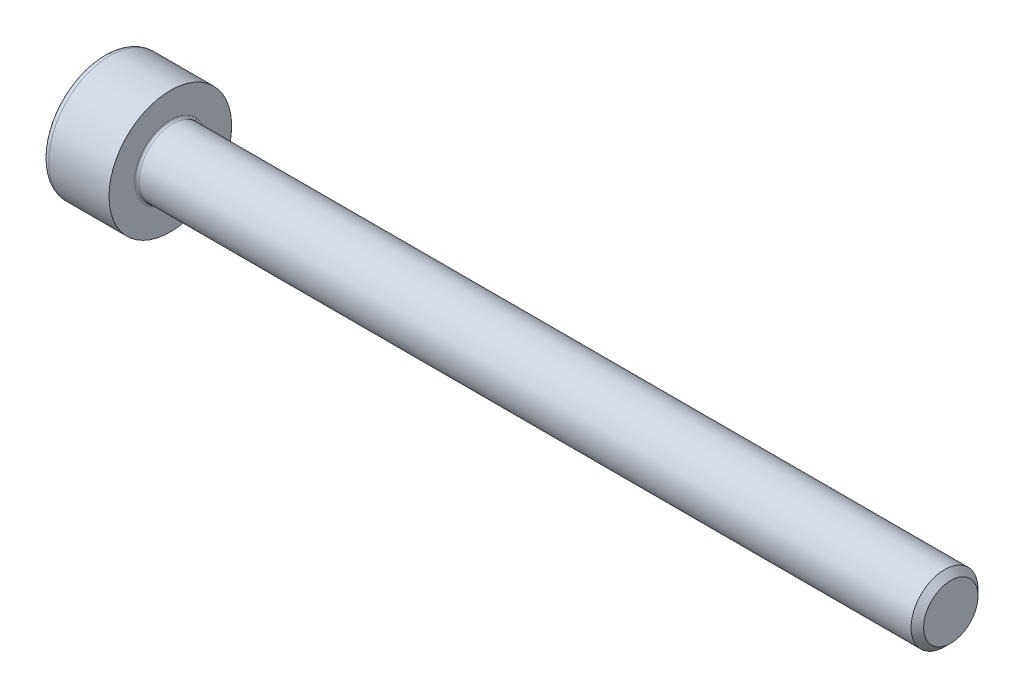
ISO-10303-21;
HEADER;
FILE_DESCRIPTION(('STEP AP214'),'2;1');
FILE_NAME('part.step','',(''),(''),'','','');
FILE_SCHEMA(('AUTOMOTIVE_DESIGN { 1 0 10303 214 1 1 1 1 }'));
ENDSEC;
DATA;
#1=APPLICATION_CONTEXT('core data for automotive mechanical design processes');
#2=APPLICATION_PROTOCOL_DEFINITION('international standard','automotive_design',2000,#1);
#3=PRODUCT_CONTEXT('',#1,'mechanical');
#4=PRODUCT('Part','Part','',(#3));
#5=PRODUCT_RELATED_PRODUCT_CATEGORY('part','',(#4));
#6=PRODUCT_DEFINITION_FORMATION('','',#4);
#7=PRODUCT_DEFINITION_CONTEXT('part definition',#1,'design');
#8=PRODUCT_DEFINITION('design','',#6,#7);
#9=PRODUCT_DEFINITION_SHAPE('','',#8);
#10=(LENGTH_UNIT() NAMED_UNIT(*) SI_UNIT(.MILLI.,.METRE.));
#11=(NAMED_UNIT(*) PLANE_ANGLE_UNIT() SI_UNIT($,.RADIAN.));
#12=(NAMED_UNIT(*) SI_UNIT($,.STERADIAN.) SOLID_ANGLE_UNIT());
#13=UNCERTAINTY_MEASURE_WITH_UNIT(LENGTH_MEASURE(1.E-05),#10,'distance_accuracy_value','');
#14=(GEOMETRIC_REPRESENTATION_CONTEXT(3) GLOBAL_UNCERTAINTY_ASSIGNED_CONTEXT((#13)) GLOBAL_UNIT_ASSIGNED_CONTEXT((#10,
#11,#12)) REPRESENTATION_CONTEXT('',''));
#15=CARTESIAN_POINT('',(0.,0.,0.));
#16=DIRECTION('',(0.,0.,1.));
#17=DIRECTION('',(1.,0.,0.));
#18=AXIS2_PLACEMENT_3D('',#15,#16,#17);
#19=CARTESIAN_POINT('',(0.,0.,0.));
#20=DIRECTION('',(-1.,0.,0.));
#21=DIRECTION('',(0.,0.,1.));
#22=AXIS2_PLACEMENT_3D('',#19,#20,#21);
#23=PLANE('',#22);
#24=DIRECTION('',(0.,-0.499999999999999,0.866025403784439));
#25=VECTOR('',#24,1.);
#26=CARTESIAN_POINT('',(0.,1.45492267835785,0.));
#27=LINE('',#26,#25);
#28=CARTESIAN_POINT('',(0.,1.45492267835785,0.));
#29=VERTEX_POINT('',#28);
#30=CARTESIAN_POINT('',(0.,0.727461339178922,1.26));
#31=VERTEX_POINT('',#30);
#32=EDGE_CURVE('E261',#29,#31,#27,.T.);
#33=ORIENTED_EDGE('',*,*,#32,.T.);
#34=DIRECTION('',(0.,1.,0.));
#35=VECTOR('',#34,1.);
#36=CARTESIAN_POINT('',(0.,-0.727461339178934,1.26));
#37=LINE('',#36,#35);
#38=CARTESIAN_POINT('',(0.,-0.727461339178934,1.26));
#39=VERTEX_POINT('',#38);
#40=EDGE_CURVE('E133',#39,#31,#37,.T.);
#41=ORIENTED_EDGE('',*,*,#40,.F.);
#42=DIRECTION('',(0.,-0.500000000000001,-0.866025403784438));
#43=VECTOR('',#42,1.);
#44=CARTESIAN_POINT('',(0.,-0.727461339178934,1.26));
#45=LINE('',#44,#43);
#46=CARTESIAN_POINT('',(0.,-1.45492267835786,0.));
#47=VERTEX_POINT('',#46);
#48=EDGE_CURVE('E264',#39,#47,#45,.T.);
#49=ORIENTED_EDGE('',*,*,#48,.T.);
#50=DIRECTION('',(0.,0.499999999999998,-0.86602540378444));
#51=VECTOR('',#50,1.);
#52=CARTESIAN_POINT('',(0.,-1.45492267835786,0.));
#53=LINE('',#52,#51);
#54=CARTESIAN_POINT('',(0.,-0.727461339178938,-1.26));
#55=VERTEX_POINT('',#54);
#56=EDGE_CURVE('E267',#47,#55,#53,.T.);
#57=ORIENTED_EDGE('',*,*,#56,.T.);
#58=DIRECTION('',(0.,-1.,0.));
#59=VECTOR('',#58,1.);
#60=CARTESIAN_POINT('',(0.,0.727461339178918,-1.26));
#61=LINE('',#60,#59);
#62=CARTESIAN_POINT('',(0.,0.727461339178918,-1.26));
#63=VERTEX_POINT('',#62);
#64=EDGE_CURVE('E270',#63,#55,#61,.T.);
#65=ORIENTED_EDGE('',*,*,#64,.F.);
#66=DIRECTION('',(0.,-0.500000000000001,-0.866025403784438));
#67=VECTOR('',#66,1.);
#68=CARTESIAN_POINT('',(0.,1.45492267835785,0.));
#69=LINE('',#68,#67);
#70=EDGE_CURVE('E128',#29,#63,#69,.T.);
#71=ORIENTED_EDGE('',*,*,#70,.F.);
#72=EDGE_LOOP('',(#33,#41,#49,#57,#65,#71));
#73=FACE_BOUND('',#72,.T.);
#74=CARTESIAN_POINT('',(0.,0.,0.));
#75=DIRECTION('',(-1.,0.,0.));
#76=DIRECTION('',(0.,0.,1.));
#77=AXIS2_PLACEMENT_3D('',#74,#75,#76);
#78=CIRCLE('',#77,2.45);
#79=CARTESIAN_POINT('',(0.,0.,2.45));
#80=VERTEX_POINT('',#79);
#81=EDGE_CURVE('E45',#80,#80,#78,.T.);
#82=ORIENTED_EDGE('',*,*,#81,.T.);
#83=EDGE_LOOP('',(#82));
#84=FACE_BOUND('',#83,.T.);
#85=ADVANCED_FACE('F37',(#73,#84),#23,.T.);
#86=CARTESIAN_POINT('',(-31.75,0.,0.));
#87=DIRECTION('',(-1.,0.,0.));
#88=DIRECTION('',(0.,0.,1.));
#89=AXIS2_PLACEMENT_3D('',#86,#87,#88);
#90=CYLINDRICAL_SURFACE('',#89,2.75);
#91=CARTESIAN_POINT('',(0.300000000000002,0.,0.));
#92=DIRECTION('',(-1.,0.,0.));
#93=DIRECTION('',(0.,0.,1.));
#94=AXIS2_PLACEMENT_3D('',#91,#92,#93);
#95=CIRCLE('',#94,2.75);
#96=CARTESIAN_POINT('',(0.300000000000002,0.,2.75));
#97=VERTEX_POINT('',#96);
#98=EDGE_CURVE('E11',#97,#97,#95,.F.);
#99=ORIENTED_EDGE('',*,*,#98,.T.);
#100=EDGE_LOOP('',(#99));
#101=FACE_BOUND('',#100,.T.);
#102=CARTESIAN_POINT('',(3.,0.,0.));
#103=DIRECTION('',(-1.,0.,0.));
#104=DIRECTION('',(0.,0.,1.));
#105=AXIS2_PLACEMENT_3D('',#102,#103,#104);
#106=CIRCLE('',#105,2.75);
#107=CARTESIAN_POINT('',(3.,0.,2.75));
#108=VERTEX_POINT('',#107);
#109=EDGE_CURVE('E151',#108,#108,#106,.T.);
#110=ORIENTED_EDGE('',*,*,#109,.T.);
#111=EDGE_LOOP('',(#110));
#112=FACE_BOUND('',#111,.T.);
#113=ADVANCED_FACE('F175',(#101,#112),#90,.T.);
#114=CARTESIAN_POINT('',(3.,2.75,0.));
#115=DIRECTION('',(1.,0.,0.));
#116=DIRECTION('',(0.,0.,-1.));
#117=AXIS2_PLACEMENT_3D('',#114,#115,#116);
#118=PLANE('',#117);
#119=CARTESIAN_POINT('',(3.,0.,0.));
#120=DIRECTION('',(1.,0.,0.));
#121=DIRECTION('',(0.,0.,-1.));
#122=AXIS2_PLACEMENT_3D('',#119,#120,#121);
#123=CIRCLE('',#122,1.59999999999994);
#124=CARTESIAN_POINT('',(3.,0.,-1.59999999999994));
#125=VERTEX_POINT('',#124);
#126=EDGE_CURVE('E154',#125,#125,#123,.F.);
#127=ORIENTED_EDGE('',*,*,#126,.T.);
#128=EDGE_LOOP('',(#127));
#129=FACE_BOUND('',#128,.T.);
#130=ORIENTED_EDGE('',*,*,#109,.F.);
#131=EDGE_LOOP('',(#130));
#132=FACE_BOUND('',#131,.T.);
#133=ADVANCED_FACE('F181',(#129,#132),#118,.T.);
#134=CARTESIAN_POINT('',(-31.75,0.,0.));
#135=DIRECTION('',(-1.,0.,0.));
#136=DIRECTION('',(0.,0.,1.));
#137=AXIS2_PLACEMENT_3D('',#134,#135,#136);
#138=CYLINDRICAL_SURFACE('',#137,1.49999999999994);
#139=CARTESIAN_POINT('',(3.1,0.,0.));
#140=DIRECTION('',(1.,0.,0.));
#141=DIRECTION('',(0.,0.,-1.));
#142=AXIS2_PLACEMENT_3D('',#139,#140,#141);
#143=CIRCLE('',#142,1.49999999999994);
#144=CARTESIAN_POINT('',(3.1,0.,-1.49999999999994));
#145=VERTEX_POINT('',#144);
#146=EDGE_CURVE('E157',#145,#145,#143,.T.);
#147=ORIENTED_EDGE('',*,*,#146,.T.);
#148=EDGE_LOOP('',(#147));
#149=FACE_BOUND('',#148,.T.);
#150=CARTESIAN_POINT('',(37.7194999999999,0.,0.));
#151=DIRECTION('',(-1.,0.,0.));
#152=DIRECTION('',(0.,0.,1.));
#153=AXIS2_PLACEMENT_3D('',#150,#151,#152);
#154=CIRCLE('',#153,1.49999999999988);
#155=CARTESIAN_POINT('',(37.7194999999999,0.,1.49999999999988));
#156=VERTEX_POINT('',#155);
#157=EDGE_CURVE('E148',#156,#156,#154,.T.);
#158=ORIENTED_EDGE('',*,*,#157,.T.);
#159=EDGE_LOOP('',(#158));
#160=FACE_BOUND('',#159,.T.);
#161=ADVANCED_FACE('F187',(#149,#160),#138,.T.);
#162=CARTESIAN_POINT('',(38.,0.,0.));
#163=DIRECTION('',(-1.,0.,0.));
#164=DIRECTION('',(0.,0.,1.));
#165=AXIS2_PLACEMENT_3D('',#162,#163,#164);
#166=CONICAL_SURFACE('',#165,1.2195,0.785398163397027);
#167=ORIENTED_EDGE('',*,*,#157,.F.);
#168=EDGE_LOOP('',(#167));
#169=FACE_BOUND('',#168,.T.);
#170=CARTESIAN_POINT('',(38.,0.,0.));
#171=DIRECTION('',(-1.,0.,0.));
#172=DIRECTION('',(0.,0.,1.));
#173=AXIS2_PLACEMENT_3D('',#170,#171,#172);
#174=CIRCLE('',#173,1.2195);
#175=CARTESIAN_POINT('',(38.,0.,1.2195));
#176=VERTEX_POINT('',#175);
#177=EDGE_CURVE('E144',#176,#176,#174,.T.);
#178=ORIENTED_EDGE('',*,*,#177,.T.);
#179=EDGE_LOOP('',(#178));
#180=FACE_BOUND('',#179,.T.);
#181=ADVANCED_FACE('F191',(#169,#180),#166,.T.);
#182=CARTESIAN_POINT('',(38.,1.2195,0.));
#183=DIRECTION('',(1.,0.,0.));
#184=DIRECTION('',(0.,0.,-1.));
#185=AXIS2_PLACEMENT_3D('',#182,#183,#184);
#186=PLANE('',#185);
#187=ORIENTED_EDGE('',*,*,#177,.F.);
#188=EDGE_LOOP('',(#187));
#189=FACE_BOUND('',#188,.T.);
#190=ADVANCED_FACE('F171',(#189),#186,.T.);
#191=CARTESIAN_POINT('',(3.1,0.,0.));
#192=DIRECTION('',(1.,0.,0.));
#193=DIRECTION('',(0.,0.,-1.));
#194=AXIS2_PLACEMENT_3D('',#191,#192,#193);
#195=TOROIDAL_SURFACE('',#194,1.59999999999994,0.1);
#196=ORIENTED_EDGE('',*,*,#146,.F.);
#197=EDGE_LOOP('',(#196));
#198=FACE_BOUND('',#197,.T.);
#199=ORIENTED_EDGE('',*,*,#126,.F.);
#200=EDGE_LOOP('',(#199));
#201=FACE_BOUND('',#200,.T.);
#202=ADVANCED_FACE('F164',(#198,#201),#195,.F.);
#203=CARTESIAN_POINT('',(0.300000000000002,0.,0.));
#204=DIRECTION('',(-1.,0.,0.));
#205=DIRECTION('',(0.,0.,1.));
#206=AXIS2_PLACEMENT_3D('',#203,#204,#205);
#207=TOROIDAL_SURFACE('',#206,2.45,0.3);
#208=ORIENTED_EDGE('',*,*,#98,.F.);
#209=EDGE_LOOP('',(#208));
#210=FACE_BOUND('',#209,.T.);
#211=ORIENTED_EDGE('',*,*,#81,.F.);
#212=EDGE_LOOP('',(#211));
#213=FACE_BOUND('',#212,.T.);
#214=ADVANCED_FACE('F39',(#210,#213),#207,.T.);
#215=CARTESIAN_POINT('',(1.3,1.45492267835785,0.));
#216=DIRECTION('',(0.,-0.866025403784439,-0.499999999999999));
#217=DIRECTION('',(0.,0.499999999999999,-0.866025403784439));
#218=AXIS2_PLACEMENT_3D('',#215,#216,#217);
#219=PLANE('',#218);
#220=ORIENTED_EDGE('',*,*,#32,.F.);
#221=DIRECTION('',(-1.,0.,0.));
#222=VECTOR('',#221,1.);
#223=CARTESIAN_POINT('',(1.3,1.45492267835785,0.));
#224=LINE('',#223,#222);
#225=CARTESIAN_POINT('',(1.3,1.45492267835785,0.));
#226=VERTEX_POINT('',#225);
#227=EDGE_CURVE('E251',#226,#29,#224,.T.);
#228=ORIENTED_EDGE('',*,*,#227,.F.);
#229=DIRECTION('',(0.,-0.499999999999999,0.866025403784439));
#230=VECTOR('',#229,1.);
#231=CARTESIAN_POINT('',(1.3,1.45492267835785,0.));
#232=LINE('',#231,#230);
#233=CARTESIAN_POINT('',(1.3,1.09119200876839,0.629999999999996));
#234=VERTEX_POINT('',#233);
#235=EDGE_CURVE('E120',#226,#234,#232,.T.);
#236=ORIENTED_EDGE('',*,*,#235,.T.);
#237=CARTESIAN_POINT('',(1.3,0.727461339178922,1.26));
#238=VERTEX_POINT('',#237);
#239=EDGE_CURVE('E111',#234,#238,#232,.T.);
#240=ORIENTED_EDGE('',*,*,#239,.T.);
#241=DIRECTION('',(-1.,0.,0.));
#242=VECTOR('',#241,1.);
#243=CARTESIAN_POINT('',(1.3,0.727461339178922,1.26));
#244=LINE('',#243,#242);
#245=EDGE_CURVE('E125',#238,#31,#244,.T.);
#246=ORIENTED_EDGE('',*,*,#245,.T.);
#247=EDGE_LOOP('',(#220,#228,#236,#240,#246));
#248=FACE_BOUND('',#247,.T.);
#249=ADVANCED_FACE('F124',(#248),#219,.T.);
#250=CARTESIAN_POINT('',(1.3,-0.727461339178934,1.26));
#251=DIRECTION('',(0.,0.,1.));
#252=DIRECTION('',(0.,-1.,0.));
#253=AXIS2_PLACEMENT_3D('',#250,#251,#252);
#254=PLANE('',#253);
#255=ORIENTED_EDGE('',*,*,#40,.T.);
#256=ORIENTED_EDGE('',*,*,#245,.F.);
#257=DIRECTION('',(0.,1.,0.));
#258=VECTOR('',#257,1.);
#259=CARTESIAN_POINT('',(1.3,-0.727461339178934,1.26));
#260=LINE('',#259,#258);
#261=CARTESIAN_POINT('',(1.3,0.,1.26));
#262=VERTEX_POINT('',#261);
#263=EDGE_CURVE('E108',#262,#238,#260,.T.);
#264=ORIENTED_EDGE('',*,*,#263,.F.);
#265=CARTESIAN_POINT('',(1.3,-0.727461339178934,1.26));
#266=VERTEX_POINT('',#265);
#267=EDGE_CURVE('E119',#266,#262,#260,.T.);
#268=ORIENTED_EDGE('',*,*,#267,.F.);
#269=DIRECTION('',(-1.,0.,0.));
#270=VECTOR('',#269,1.);
#271=CARTESIAN_POINT('',(1.3,-0.727461339178934,1.26));
#272=LINE('',#271,#270);
#273=EDGE_CURVE('E135',#266,#39,#272,.T.);
#274=ORIENTED_EDGE('',*,*,#273,.T.);
#275=EDGE_LOOP('',(#255,#256,#264,#268,#274));
#276=FACE_BOUND('',#275,.T.);
#277=ADVANCED_FACE('F130',(#276),#254,.F.);
#278=CARTESIAN_POINT('',(1.3,-0.727461339178934,1.26));
#279=DIRECTION('',(0.,0.866025403784438,-0.500000000000001));
#280=DIRECTION('',(0.,0.500000000000001,0.866025403784438));
#281=AXIS2_PLACEMENT_3D('',#278,#279,#280);
#282=PLANE('',#281);
#283=ORIENTED_EDGE('',*,*,#48,.F.);
#284=ORIENTED_EDGE('',*,*,#273,.F.);
#285=DIRECTION('',(0.,-0.500000000000001,-0.866025403784438));
#286=VECTOR('',#285,1.);
#287=CARTESIAN_POINT('',(1.3,-0.727461339178934,1.26));
#288=LINE('',#287,#286);
#289=CARTESIAN_POINT('',(1.3,-1.0911920087684,0.630000000000005));
#290=VERTEX_POINT('',#289);
#291=EDGE_CURVE('E290',#266,#290,#288,.T.);
#292=ORIENTED_EDGE('',*,*,#291,.T.);
#293=CARTESIAN_POINT('',(1.3,-1.45492267835786,0.));
#294=VERTEX_POINT('',#293);
#295=EDGE_CURVE('E279',#290,#294,#288,.T.);
#296=ORIENTED_EDGE('',*,*,#295,.T.);
#297=DIRECTION('',(-1.,0.,0.));
#298=VECTOR('',#297,1.);
#299=CARTESIAN_POINT('',(1.3,-1.45492267835786,0.));
#300=LINE('',#299,#298);
#301=EDGE_CURVE('E140',#294,#47,#300,.T.);
#302=ORIENTED_EDGE('',*,*,#301,.T.);
#303=EDGE_LOOP('',(#283,#284,#292,#296,#302));
#304=FACE_BOUND('',#303,.T.);
#305=ADVANCED_FACE('F205',(#304),#282,.T.);
#306=CARTESIAN_POINT('',(1.3,-1.45492267835786,0.));
#307=DIRECTION('',(0.,0.86602540378444,0.499999999999998));
#308=DIRECTION('',(0.,-0.499999999999998,0.86602540378444));
#309=AXIS2_PLACEMENT_3D('',#306,#307,#308);
#310=PLANE('',#309);
#311=ORIENTED_EDGE('',*,*,#56,.F.);
#312=ORIENTED_EDGE('',*,*,#301,.F.);
#313=DIRECTION('',(0.,0.499999999999998,-0.86602540378444));
#314=VECTOR('',#313,1.);
#315=CARTESIAN_POINT('',(1.3,-1.45492267835786,0.));
#316=LINE('',#315,#314);
#317=CARTESIAN_POINT('',(1.3,-1.0911920087684,-0.63));
#318=VERTEX_POINT('',#317);
#319=EDGE_CURVE('E257',#294,#318,#316,.T.);
#320=ORIENTED_EDGE('',*,*,#319,.T.);
#321=CARTESIAN_POINT('',(1.3,-0.727461339178938,-1.26));
#322=VERTEX_POINT('',#321);
#323=EDGE_CURVE('E289',#318,#322,#316,.T.);
#324=ORIENTED_EDGE('',*,*,#323,.T.);
#325=DIRECTION('',(-1.,0.,0.));
#326=VECTOR('',#325,1.);
#327=CARTESIAN_POINT('',(1.3,-0.727461339178938,-1.26));
#328=LINE('',#327,#326);
#329=EDGE_CURVE('E250',#322,#55,#328,.T.);
#330=ORIENTED_EDGE('',*,*,#329,.T.);
#331=EDGE_LOOP('',(#311,#312,#320,#324,#330));
#332=FACE_BOUND('',#331,.T.);
#333=ADVANCED_FACE('F208',(#332),#310,.T.);
#334=CARTESIAN_POINT('',(1.3,0.727461339178918,-1.26));
#335=DIRECTION('',(0.,0.,-1.));
#336=DIRECTION('',(0.,1.,0.));
#337=AXIS2_PLACEMENT_3D('',#334,#335,#336);
#338=PLANE('',#337);
#339=ORIENTED_EDGE('',*,*,#64,.T.);
#340=ORIENTED_EDGE('',*,*,#329,.F.);
#341=DIRECTION('',(0.,-1.,0.));
#342=VECTOR('',#341,1.);
#343=CARTESIAN_POINT('',(1.3,0.727461339178918,-1.26));
#344=LINE('',#343,#342);
#345=CARTESIAN_POINT('',(1.3,0.,-1.26));
#346=VERTEX_POINT('',#345);
#347=EDGE_CURVE('E254',#346,#322,#344,.T.);
#348=ORIENTED_EDGE('',*,*,#347,.F.);
#349=CARTESIAN_POINT('',(1.3,0.727461339178918,-1.26));
#350=VERTEX_POINT('',#349);
#351=EDGE_CURVE('E52',#350,#346,#344,.T.);
#352=ORIENTED_EDGE('',*,*,#351,.F.);
#353=DIRECTION('',(-1.,0.,0.));
#354=VECTOR('',#353,1.);
#355=CARTESIAN_POINT('',(1.3,0.727461339178918,-1.26));
#356=LINE('',#355,#354);
#357=EDGE_CURVE('E247',#350,#63,#356,.T.);
#358=ORIENTED_EDGE('',*,*,#357,.T.);
#359=EDGE_LOOP('',(#339,#340,#348,#352,#358));
#360=FACE_BOUND('',#359,.T.);
#361=ADVANCED_FACE('F212',(#360),#338,.F.);
#362=CARTESIAN_POINT('',(1.3,1.45492267835785,0.));
#363=DIRECTION('',(0.,0.866025403784438,-0.500000000000001));
#364=DIRECTION('',(0.,0.500000000000001,0.866025403784438));
#365=AXIS2_PLACEMENT_3D('',#362,#363,#364);
#366=PLANE('',#365);
#367=ORIENTED_EDGE('',*,*,#70,.T.);
#368=ORIENTED_EDGE('',*,*,#357,.F.);
#369=DIRECTION('',(0.,-0.500000000000001,-0.866025403784438));
#370=VECTOR('',#369,1.);
#371=CARTESIAN_POINT('',(1.3,1.45492267835785,0.));
#372=LINE('',#371,#370);
#373=CARTESIAN_POINT('',(1.3,1.09119200876838,-0.629999999999997));
#374=VERTEX_POINT('',#373);
#375=EDGE_CURVE('E237',#374,#350,#372,.T.);
#376=ORIENTED_EDGE('',*,*,#375,.F.);
#377=EDGE_CURVE('E243',#226,#374,#372,.T.);
#378=ORIENTED_EDGE('',*,*,#377,.F.);
#379=ORIENTED_EDGE('',*,*,#227,.T.);
#380=EDGE_LOOP('',(#367,#368,#376,#378,#379));
#381=FACE_BOUND('',#380,.T.);
#382=ADVANCED_FACE('F216',(#381),#366,.F.);
#383=CARTESIAN_POINT('',(1.3,2.18238401753677,-1.26));
#384=DIRECTION('',(1.,0.,0.));
#385=DIRECTION('',(0.,0.,-1.));
#386=AXIS2_PLACEMENT_3D('',#383,#384,#385);
#387=PLANE('',#386);
#388=ORIENTED_EDGE('',*,*,#347,.T.);
#389=ORIENTED_EDGE('',*,*,#323,.F.);
#390=CARTESIAN_POINT('',(1.3,0.,0.));
#391=DIRECTION('',(-1.,0.,0.));
#392=DIRECTION('',(0.,0.,1.));
#393=AXIS2_PLACEMENT_3D('',#390,#391,#392);
#394=CIRCLE('',#393,1.26);
#395=EDGE_CURVE('E285',#346,#318,#394,.T.);
#396=ORIENTED_EDGE('',*,*,#395,.F.);
#397=EDGE_LOOP('',(#388,#389,#396));
#398=FACE_BOUND('',#397,.T.);
#399=ADVANCED_FACE('F220',(#398),#387,.F.);
#400=ORIENTED_EDGE('',*,*,#319,.F.);
#401=ORIENTED_EDGE('',*,*,#295,.F.);
#402=EDGE_CURVE('E138',#318,#290,#394,.T.);
#403=ORIENTED_EDGE('',*,*,#402,.F.);
#404=EDGE_LOOP('',(#400,#401,#403));
#405=FACE_BOUND('',#404,.T.);
#406=ADVANCED_FACE('F223',(#405),#387,.F.);
#407=ORIENTED_EDGE('',*,*,#291,.F.);
#408=ORIENTED_EDGE('',*,*,#267,.T.);
#409=EDGE_CURVE('E134',#290,#262,#394,.T.);
#410=ORIENTED_EDGE('',*,*,#409,.F.);
#411=EDGE_LOOP('',(#407,#408,#410));
#412=FACE_BOUND('',#411,.T.);
#413=ADVANCED_FACE('F228',(#412),#387,.F.);
#414=ORIENTED_EDGE('',*,*,#263,.T.);
#415=ORIENTED_EDGE('',*,*,#239,.F.);
#416=EDGE_CURVE('E114',#262,#234,#394,.T.);
#417=ORIENTED_EDGE('',*,*,#416,.F.);
#418=EDGE_LOOP('',(#414,#415,#417));
#419=FACE_BOUND('',#418,.T.);
#420=ADVANCED_FACE('F110',(#419),#387,.F.);
#421=ORIENTED_EDGE('',*,*,#235,.F.);
#422=ORIENTED_EDGE('',*,*,#377,.T.);
#423=EDGE_CURVE('E145',#234,#374,#394,.T.);
#424=ORIENTED_EDGE('',*,*,#423,.F.);
#425=EDGE_LOOP('',(#421,#422,#424));
#426=FACE_BOUND('',#425,.T.);
#427=ADVANCED_FACE('F231',(#426),#387,.F.);
#428=ORIENTED_EDGE('',*,*,#375,.T.);
#429=ORIENTED_EDGE('',*,*,#351,.T.);
#430=EDGE_CURVE('E240',#374,#346,#394,.T.);
#431=ORIENTED_EDGE('',*,*,#430,.F.);
#432=EDGE_LOOP('',(#428,#429,#431));
#433=FACE_BOUND('',#432,.T.);
#434=ADVANCED_FACE('F201',(#433),#387,.F.);
#435=CARTESIAN_POINT('',(1.3,0.,0.));
#436=DIRECTION('',(-1.,0.,0.));
#437=DIRECTION('',(0.,0.,1.));
#438=AXIS2_PLACEMENT_3D('',#435,#436,#437);
#439=CONICAL_SURFACE('',#438,1.26,1.04719755119659);
#440=CARTESIAN_POINT('',(2.02746133917894,0.,0.));
#441=VERTEX_POINT('',#440);
#442=VERTEX_LOOP('',#441);
#443=FACE_BOUND('',#442,.T.);
#444=ORIENTED_EDGE('',*,*,#416,.T.);
#445=ORIENTED_EDGE('',*,*,#423,.T.);
#446=ORIENTED_EDGE('',*,*,#430,.T.);
#447=ORIENTED_EDGE('',*,*,#395,.T.);
#448=ORIENTED_EDGE('',*,*,#402,.T.);
#449=ORIENTED_EDGE('',*,*,#409,.T.);
#450=EDGE_LOOP('',(#444,#445,#446,#447,#448,#449));
#451=FACE_BOUND('',#450,.T.);
#452=ADVANCED_FACE('F199',(#443,#451),#439,.F.);
#453=CLOSED_SHELL('',(#85,#113,#133,#161,#181,#190,#202,#214,#249,#277,#305,#333,#361,#382,#399,
#406,#413,#420,#427,#434,#452));
#454=MANIFOLD_SOLID_BREP('B2',#453);
#455=ADVANCED_BREP_SHAPE_REPRESENTATION('',(#18,#454),#14);
#456=SHAPE_DEFINITION_REPRESENTATION(#9,#455);
ENDSEC;
END-ISO-10303-21;
